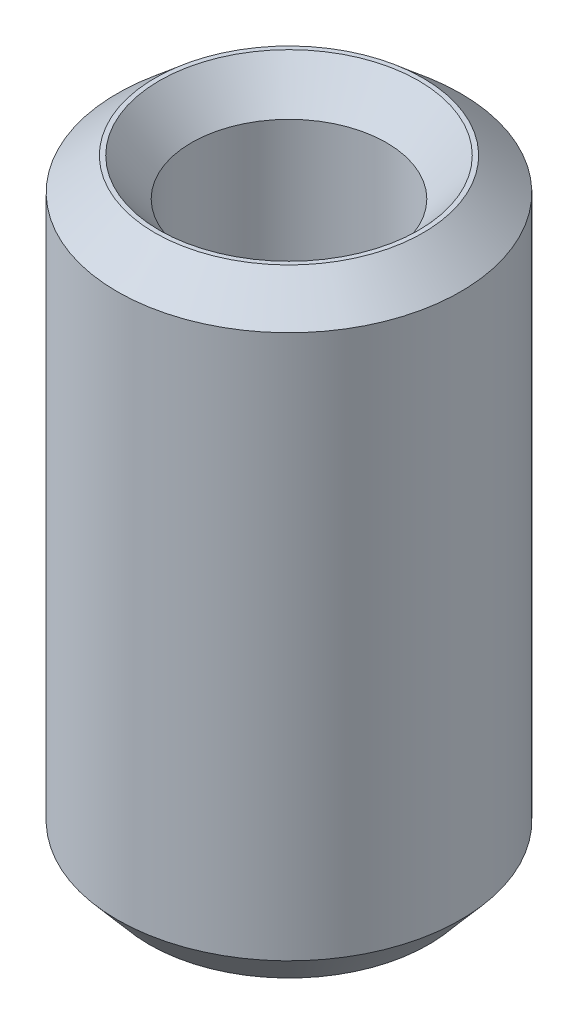
ISO-10303-21;
HEADER;
FILE_DESCRIPTION(('STEP AP214'),'2;1');
FILE_NAME('part.step','',(''),(''),'','','');
FILE_SCHEMA(('AUTOMOTIVE_DESIGN { 1 0 10303 214 1 1 1 1 }'));
ENDSEC;
DATA;
#1=APPLICATION_CONTEXT('core data for automotive mechanical design processes');
#2=APPLICATION_PROTOCOL_DEFINITION('international standard','automotive_design',2000,#1);
#3=PRODUCT_CONTEXT('',#1,'mechanical');
#4=PRODUCT('Part','Part','',(#3));
#5=PRODUCT_RELATED_PRODUCT_CATEGORY('part','',(#4));
#6=PRODUCT_DEFINITION_FORMATION('','',#4);
#7=PRODUCT_DEFINITION_CONTEXT('part definition',#1,'design');
#8=PRODUCT_DEFINITION('design','',#6,#7);
#9=PRODUCT_DEFINITION_SHAPE('','',#8);
#10=(LENGTH_UNIT() NAMED_UNIT(*) SI_UNIT(.MILLI.,.METRE.));
#11=(NAMED_UNIT(*) PLANE_ANGLE_UNIT() SI_UNIT($,.RADIAN.));
#12=(NAMED_UNIT(*) SI_UNIT($,.STERADIAN.) SOLID_ANGLE_UNIT());
#13=UNCERTAINTY_MEASURE_WITH_UNIT(LENGTH_MEASURE(1.E-05),#10,'distance_accuracy_value','');
#14=(GEOMETRIC_REPRESENTATION_CONTEXT(3) GLOBAL_UNCERTAINTY_ASSIGNED_CONTEXT((#13)) GLOBAL_UNIT_ASSIGNED_CONTEXT((#10,
#11,#12)) REPRESENTATION_CONTEXT('',''));
#15=CARTESIAN_POINT('',(0.,0.,0.));
#16=DIRECTION('',(0.,0.,1.));
#17=DIRECTION('',(1.,0.,0.));
#18=AXIS2_PLACEMENT_3D('',#15,#16,#17);
#19=CARTESIAN_POINT('',(0.,53.6103072465279,0.));
#20=DIRECTION('',(0.,-1.,0.));
#21=DIRECTION('',(0.,0.,-1.));
#22=AXIS2_PLACEMENT_3D('',#19,#20,#21);
#23=CYLINDRICAL_SURFACE('',#22,15.);
#24=CARTESIAN_POINT('',(0.,3.28486717726474,0.));
#25=DIRECTION('',(0.,1.,0.));
#26=DIRECTION('',(0.,0.,1.));
#27=AXIS2_PLACEMENT_3D('',#24,#25,#26);
#28=CIRCLE('',#27,15.);
#29=CARTESIAN_POINT('',(0.,3.28486717726473,-15.));
#30=VERTEX_POINT('',#29);
#31=EDGE_CURVE('E10',#30,#30,#28,.T.);
#32=CARTESIAN_POINT('',(0.,50.8042063282437,0.));
#33=DIRECTION('',(0.,1.,0.));
#34=DIRECTION('',(0.,0.,1.));
#35=AXIS2_PLACEMENT_3D('',#32,#33,#34);
#36=CIRCLE('',#35,15.);
#37=CARTESIAN_POINT('',(0.,50.8042063282437,-15.));
#38=VERTEX_POINT('',#37);
#39=EDGE_CURVE('E50',#38,#38,#36,.F.);
#40=CARTESIAN_POINT('',(0.,3.28486717726473,-15.));
#41=CARTESIAN_POINT('',(0.,3.77986029342077,-15.));
#42=CARTESIAN_POINT('',(0.,4.2748534095768,-15.));
#43=CARTESIAN_POINT('',(0.,5.26483964188886,-15.));
#44=CARTESIAN_POINT('',(0.,5.75983275804489,-15.));
#45=CARTESIAN_POINT('',(0.,6.74981899035695,-15.));
#46=CARTESIAN_POINT('',(0.,7.24481210651298,-15.));
#47=CARTESIAN_POINT('',(0.,8.23479833882505,-15.));
#48=CARTESIAN_POINT('',(0.,8.72979145498108,-15.));
#49=CARTESIAN_POINT('',(0.,9.71977768729314,-15.));
#50=CARTESIAN_POINT('',(0.,10.2147708034492,-15.));
#51=CARTESIAN_POINT('',(0.,11.2047570357612,-15.));
#52=CARTESIAN_POINT('',(0.,11.6997501519173,-15.));
#53=CARTESIAN_POINT('',(0.,12.6897363842293,-15.));
#54=CARTESIAN_POINT('',(0.,13.1847295003854,-15.));
#55=CARTESIAN_POINT('',(0.,14.1747157326974,-15.));
#56=CARTESIAN_POINT('',(0.,14.6697088488534,-15.));
#57=CARTESIAN_POINT('',(0.,15.6596950811655,-15.));
#58=CARTESIAN_POINT('',(0.,16.1546881973215,-15.));
#59=CARTESIAN_POINT('',(0.,17.1446744296336,-15.));
#60=CARTESIAN_POINT('',(0.,17.6396675457896,-15.));
#61=CARTESIAN_POINT('',(0.,18.6296537781017,-15.));
#62=CARTESIAN_POINT('',(0.,19.1246468942577,-15.));
#63=CARTESIAN_POINT('',(0.,20.1146331265698,-15.));
#64=CARTESIAN_POINT('',(0.,20.6096262427258,-15.));
#65=CARTESIAN_POINT('',(0.,21.5996124750379,-15.));
#66=CARTESIAN_POINT('',(0.,22.0946055911939,-15.));
#67=CARTESIAN_POINT('',(0.,23.084591823506,-15.));
#68=CARTESIAN_POINT('',(0.,23.579584939662,-15.));
#69=CARTESIAN_POINT('',(0.,24.5695711719741,-15.));
#70=CARTESIAN_POINT('',(0.,25.0645642881301,-15.));
#71=CARTESIAN_POINT('',(0.,26.0545505204422,-15.));
#72=CARTESIAN_POINT('',(0.,26.5495436365982,-15.));
#73=CARTESIAN_POINT('',(0.,27.5395298689103,-15.));
#74=CARTESIAN_POINT('',(0.,28.0345229850663,-15.));
#75=CARTESIAN_POINT('',(0.,29.0245092173783,-15.));
#76=CARTESIAN_POINT('',(0.,29.5195023335344,-15.));
#77=CARTESIAN_POINT('',(0.,30.5094885658464,-15.));
#78=CARTESIAN_POINT('',(0.,31.0044816820025,-15.));
#79=CARTESIAN_POINT('',(0.,31.9944679143145,-15.));
#80=CARTESIAN_POINT('',(0.,32.4894610304706,-15.));
#81=CARTESIAN_POINT('',(0.,33.4794472627826,-15.));
#82=CARTESIAN_POINT('',(0.,33.9744403789387,-15.));
#83=CARTESIAN_POINT('',(0.,34.9644266112507,-15.));
#84=CARTESIAN_POINT('',(0.,35.4594197274068,-15.));
#85=CARTESIAN_POINT('',(0.,36.4494059597188,-15.));
#86=CARTESIAN_POINT('',(0.,36.9443990758748,-15.));
#87=CARTESIAN_POINT('',(0.,37.9343853081869,-15.));
#88=CARTESIAN_POINT('',(0.,38.4293784243429,-15.));
#89=CARTESIAN_POINT('',(0.,39.419364656655,-15.));
#90=CARTESIAN_POINT('',(0.,39.914357772811,-15.));
#91=CARTESIAN_POINT('',(0.,40.9043440051231,-15.));
#92=CARTESIAN_POINT('',(0.,41.3993371212791,-15.));
#93=CARTESIAN_POINT('',(0.,42.3893233535912,-15.));
#94=CARTESIAN_POINT('',(0.,42.8843164697472,-15.));
#95=CARTESIAN_POINT('',(0.,43.8743027020593,-15.));
#96=CARTESIAN_POINT('',(0.,44.3692958182153,-15.));
#97=CARTESIAN_POINT('',(0.,45.3592820505274,-15.));
#98=CARTESIAN_POINT('',(0.,45.8542751666834,-15.));
#99=CARTESIAN_POINT('',(0.,46.8442613989955,-15.));
#100=CARTESIAN_POINT('',(0.,47.3392545151515,-15.));
#101=CARTESIAN_POINT('',(0.,48.3292407474636,-15.));
#102=CARTESIAN_POINT('',(0.,48.8242338636196,-15.));
#103=CARTESIAN_POINT('',(0.,49.8142200959316,-15.));
#104=CARTESIAN_POINT('',(0.,50.3092132120877,-15.));
#105=CARTESIAN_POINT('',(0.,50.8042063282437,-15.));
#106=B_SPLINE_CURVE_WITH_KNOTS('',3,(#40,#41,#42,#43,#44,#45,#46,#47,#48,#49,#50,#51,#52,#53,
#54,#55,#56,#57,#58,#59,#60,#61,#62,#63,#64,#65,#66,#67,#68,#69,#70,#71,#72,#73,#74,#75,#76,#77,
#78,#79,#80,#81,#82,#83,#84,#85,#86,#87,#88,#89,#90,#91,#92,#93,#94,#95,#96,#97,#98,#99,#100,
#101,#102,#103,#104,#105),.UNSPECIFIED.,.F.,.F.,(4,2,2,2,2,2,2,2,2,2,2,2,2,2,2,2,2,2,2,2,2,2,2,
2,2,2,2,2,2,2,2,2,4),(0.,1.48497934846809,2.96995869693618,4.45493804540428,5.93991739387238,
7.42489674234047,8.90987609080856,10.3948554392767,11.8798347877447,13.3648141362128,
14.8497934846809,16.334772833149,17.8197521816171,19.3047315300852,20.7897108785533,
22.2746902270214,23.7596695754895,25.2446489239576,26.7296282724257,28.2146076208938,
29.6995869693619,31.18456631783,32.669545666298,34.1545250147661,35.6395043632342,
37.1244837117023,38.6094630601704,40.0944424086385,41.5794217571066,43.0644011055747,
44.5493804540428,46.0343598025109,47.519339150979),.UNSPECIFIED.);
#107=EDGE_CURVE('BSEAM39',#30,#38,#106,.T.);
#108=ORIENTED_EDGE('',*,*,#31,.T.);
#109=ORIENTED_EDGE('',*,*,#39,.T.);
#110=ORIENTED_EDGE('',*,*,#107,.T.);
#111=ORIENTED_EDGE('',*,*,#107,.F.);
#112=EDGE_LOOP('',(#108,#110,#109,#111));
#113=FACE_BOUND('',#112,.T.);
#114=ADVANCED_FACE('F39',(#113),#23,.T.);
#115=CARTESIAN_POINT('',(0.,53.6103072465279,0.));
#116=DIRECTION('',(0.,1.,0.));
#117=DIRECTION('',(0.,0.,1.));
#118=AXIS2_PLACEMENT_3D('',#115,#116,#117);
#119=PLANE('',#118);
#120=CARTESIAN_POINT('',(0.,53.6103072465279,0.));
#121=DIRECTION('',(0.,1.,0.));
#122=DIRECTION('',(0.,0.,1.));
#123=AXIS2_PLACEMENT_3D('',#120,#121,#122);
#124=CIRCLE('',#123,11.3215243879318);
#125=CARTESIAN_POINT('',(0.,53.6103072465279,11.3215243879318));
#126=VERTEX_POINT('',#125);
#127=EDGE_CURVE('E58',#126,#126,#124,.F.);
#128=ORIENTED_EDGE('',*,*,#127,.T.);
#129=EDGE_LOOP('',(#128));
#130=FACE_BOUND('',#129,.T.);
#131=CARTESIAN_POINT('',(0.,53.6103072465279,0.));
#132=DIRECTION('',(0.,1.,0.));
#133=DIRECTION('',(0.,0.,1.));
#134=AXIS2_PLACEMENT_3D('',#131,#132,#133);
#135=CIRCLE('',#134,11.7151328227354);
#136=CARTESIAN_POINT('',(0.,53.6103072465279,-11.7151328227354));
#137=VERTEX_POINT('',#136);
#138=EDGE_CURVE('E61',#137,#137,#135,.T.);
#139=ORIENTED_EDGE('',*,*,#138,.T.);
#140=EDGE_LOOP('',(#139));
#141=FACE_BOUND('',#140,.T.);
#142=ADVANCED_FACE('F88',(#130,#141),#119,.T.);
#143=CARTESIAN_POINT('',(0.,0.,0.));
#144=DIRECTION('',(0.,1.,0.));
#145=DIRECTION('',(0.,0.,1.));
#146=AXIS2_PLACEMENT_3D('',#143,#144,#145);
#147=PLANE('',#146);
#148=CARTESIAN_POINT('',(0.,0.,0.));
#149=DIRECTION('',(0.,1.,0.));
#150=DIRECTION('',(0.,0.,1.));
#151=AXIS2_PLACEMENT_3D('',#148,#149,#150);
#152=CIRCLE('',#151,11.8002906469122);
#153=CARTESIAN_POINT('',(0.,0.,11.8002906469122));
#154=VERTEX_POINT('',#153);
#155=EDGE_CURVE('E51',#154,#154,#152,.T.);
#156=ORIENTED_EDGE('',*,*,#155,.T.);
#157=EDGE_LOOP('',(#156));
#158=FACE_BOUND('',#157,.T.);
#159=CARTESIAN_POINT('',(0.,0.,0.));
#160=DIRECTION('',(0.,1.,0.));
#161=DIRECTION('',(0.,0.,1.));
#162=AXIS2_PLACEMENT_3D('',#159,#160,#161);
#163=CIRCLE('',#162,12.1938990817157);
#164=CARTESIAN_POINT('',(0.,0.,12.1938990817157));
#165=VERTEX_POINT('',#164);
#166=EDGE_CURVE('E54',#165,#165,#163,.F.);
#167=ORIENTED_EDGE('',*,*,#166,.T.);
#168=EDGE_LOOP('',(#167));
#169=FACE_BOUND('',#168,.T.);
#170=ADVANCED_FACE('F83',(#158,#169),#147,.F.);
#171=CARTESIAN_POINT('',(0.,53.6103072465279,0.));
#172=DIRECTION('',(0.,-1.,0.));
#173=DIRECTION('',(0.,0.,-1.));
#174=AXIS2_PLACEMENT_3D('',#171,#172,#173);
#175=CYLINDRICAL_SURFACE('',#174,8.51542346964752);
#176=CARTESIAN_POINT('',(0.,50.3254400692632,0.));
#177=DIRECTION('',(0.,1.,0.));
#178=DIRECTION('',(0.,0.,1.));
#179=AXIS2_PLACEMENT_3D('',#176,#177,#178);
#180=CIRCLE('',#179,8.51542346964752);
#181=CARTESIAN_POINT('',(0.,50.3254400692632,-8.51542346964752));
#182=VERTEX_POINT('',#181);
#183=EDGE_CURVE('E67',#182,#182,#180,.T.);
#184=CARTESIAN_POINT('',(0.,2.80610091828423,0.));
#185=DIRECTION('',(0.,1.,0.));
#186=DIRECTION('',(0.,0.,1.));
#187=AXIS2_PLACEMENT_3D('',#184,#185,#186);
#188=CIRCLE('',#187,8.51542346964752);
#189=CARTESIAN_POINT('',(0.,2.80610091828423,-8.51542346964752));
#190=VERTEX_POINT('',#189);
#191=EDGE_CURVE('E69',#190,#190,#188,.F.);
#192=CARTESIAN_POINT('',(0.,50.3254400692632,-8.51542346964752));
#193=CARTESIAN_POINT('',(0.,49.8304469531072,-8.51542346964752));
#194=CARTESIAN_POINT('',(0.,49.3354538369511,-8.51542346964752));
#195=CARTESIAN_POINT('',(0.,48.3454676046391,-8.51542346964752));
#196=CARTESIAN_POINT('',(0.,47.850474488483,-8.51542346964752));
#197=CARTESIAN_POINT('',(0.,46.860488256171,-8.51542346964752));
#198=CARTESIAN_POINT('',(0.,46.3654951400149,-8.51542346964752));
#199=CARTESIAN_POINT('',(0.,45.3755089077029,-8.51542346964752));
#200=CARTESIAN_POINT('',(0.,44.8805157915468,-8.51542346964752));
#201=CARTESIAN_POINT('',(0.,43.8905295592348,-8.51542346964752));
#202=CARTESIAN_POINT('',(0.,43.3955364430788,-8.51542346964752));
#203=CARTESIAN_POINT('',(0.,42.4055502107667,-8.51542346964752));
#204=CARTESIAN_POINT('',(0.,41.9105570946107,-8.51542346964752));
#205=CARTESIAN_POINT('',(0.,40.9205708622986,-8.51542346964752));
#206=CARTESIAN_POINT('',(0.,40.4255777461426,-8.51542346964752));
#207=CARTESIAN_POINT('',(0.,39.4355915138305,-8.51542346964752));
#208=CARTESIAN_POINT('',(0.,38.9405983976745,-8.51542346964752));
#209=CARTESIAN_POINT('',(0.,37.9506121653624,-8.51542346964752));
#210=CARTESIAN_POINT('',(0.,37.4556190492064,-8.51542346964752));
#211=CARTESIAN_POINT('',(0.,36.4656328168943,-8.51542346964752));
#212=CARTESIAN_POINT('',(0.,35.9706397007383,-8.51542346964752));
#213=CARTESIAN_POINT('',(0.,34.9806534684262,-8.51542346964752));
#214=CARTESIAN_POINT('',(0.,34.4856603522702,-8.51542346964752));
#215=CARTESIAN_POINT('',(0.,33.4956741199581,-8.51542346964752));
#216=CARTESIAN_POINT('',(0.,33.0006810038021,-8.51542346964752));
#217=CARTESIAN_POINT('',(0.,32.0106947714901,-8.51542346964752));
#218=CARTESIAN_POINT('',(0.,31.515701655334,-8.51542346964752));
#219=CARTESIAN_POINT('',(0.,30.525715423022,-8.51542346964752));
#220=CARTESIAN_POINT('',(0.,30.0307223068659,-8.51542346964752));
#221=CARTESIAN_POINT('',(0.,29.0407360745539,-8.51542346964752));
#222=CARTESIAN_POINT('',(0.,28.5457429583978,-8.51542346964752));
#223=CARTESIAN_POINT('',(0.,27.5557567260858,-8.51542346964752));
#224=CARTESIAN_POINT('',(0.,27.0607636099297,-8.51542346964752));
#225=CARTESIAN_POINT('',(0.,26.0707773776177,-8.51542346964752));
#226=CARTESIAN_POINT('',(0.,25.5757842614617,-8.51542346964752));
#227=CARTESIAN_POINT('',(0.,24.5857980291496,-8.51542346964752));
#228=CARTESIAN_POINT('',(0.,24.0908049129936,-8.51542346964752));
#229=CARTESIAN_POINT('',(0.,23.1008186806815,-8.51542346964752));
#230=CARTESIAN_POINT('',(0.,22.6058255645255,-8.51542346964752));
#231=CARTESIAN_POINT('',(0.,21.6158393322134,-8.51542346964752));
#232=CARTESIAN_POINT('',(0.,21.1208462160574,-8.51542346964752));
#233=CARTESIAN_POINT('',(0.,20.1308599837453,-8.51542346964752));
#234=CARTESIAN_POINT('',(0.,19.6358668675893,-8.51542346964752));
#235=CARTESIAN_POINT('',(0.,18.6458806352772,-8.51542346964752));
#236=CARTESIAN_POINT('',(0.,18.1508875191212,-8.51542346964752));
#237=CARTESIAN_POINT('',(0.,17.1609012868091,-8.51542346964752));
#238=CARTESIAN_POINT('',(0.,16.6659081706531,-8.51542346964752));
#239=CARTESIAN_POINT('',(0.,15.675921938341,-8.51542346964752));
#240=CARTESIAN_POINT('',(0.,15.180928822185,-8.51542346964752));
#241=CARTESIAN_POINT('',(0.,14.1909425898729,-8.51542346964752));
#242=CARTESIAN_POINT('',(0.,13.6959494737169,-8.51542346964752));
#243=CARTESIAN_POINT('',(0.,12.7059632414048,-8.51542346964752));
#244=CARTESIAN_POINT('',(0.,12.2109701252488,-8.51542346964752));
#245=CARTESIAN_POINT('',(0.,11.2209838929368,-8.51542346964752));
#246=CARTESIAN_POINT('',(0.,10.7259907767807,-8.51542346964752));
#247=CARTESIAN_POINT('',(0.,9.73600454446866,-8.51542346964752));
#248=CARTESIAN_POINT('',(0.,9.24101142831263,-8.51542346964752));
#249=CARTESIAN_POINT('',(0.,8.25102519600057,-8.51542346964752));
#250=CARTESIAN_POINT('',(0.,7.75603207984454,-8.51542346964752));
#251=CARTESIAN_POINT('',(0.,6.76604584753248,-8.51542346964752));
#252=CARTESIAN_POINT('',(0.,6.27105273137644,-8.51542346964752));
#253=CARTESIAN_POINT('',(0.,5.28106649906438,-8.51542346964752));
#254=CARTESIAN_POINT('',(0.,4.78607338290835,-8.51542346964752));
#255=CARTESIAN_POINT('',(0.,3.79608715059629,-8.51542346964752));
#256=CARTESIAN_POINT('',(0.,3.30109403444026,-8.51542346964752));
#257=CARTESIAN_POINT('',(0.,2.80610091828423,-8.51542346964752));
#258=B_SPLINE_CURVE_WITH_KNOTS('',3,(#192,#193,#194,#195,#196,#197,#198,#199,#200,#201,#202,
#203,#204,#205,#206,#207,#208,#209,#210,#211,#212,#213,#214,#215,#216,#217,#218,#219,#220,#221,
#222,#223,#224,#225,#226,#227,#228,#229,#230,#231,#232,#233,#234,#235,#236,#237,#238,#239,#240,
#241,#242,#243,#244,#245,#246,#247,#248,#249,#250,#251,#252,#253,#254,#255,#256,#257),
.UNSPECIFIED.,.F.,.F.,(4,2,2,2,2,2,2,2,2,2,2,2,2,2,2,2,2,2,2,2,2,2,2,2,2,2,2,2,2,2,2,2,4),(0.,
1.48497934846809,2.96995869693619,4.45493804540428,5.93991739387238,7.42489674234047,
8.90987609080856,10.3948554392767,11.8798347877447,13.3648141362128,14.8497934846809,
16.334772833149,17.8197521816171,19.3047315300852,20.7897108785533,22.2746902270214,
23.7596695754895,25.2446489239576,26.7296282724257,28.2146076208938,29.6995869693619,
31.1845663178299,32.669545666298,34.1545250147661,35.6395043632342,37.1244837117023,
38.6094630601704,40.0944424086385,41.5794217571066,43.0644011055747,44.5493804540428,
46.0343598025109,47.519339150979),.UNSPECIFIED.);
#259=EDGE_CURVE('BSEAM71',#182,#190,#258,.T.);
#260=ORIENTED_EDGE('',*,*,#183,.T.);
#261=ORIENTED_EDGE('',*,*,#191,.T.);
#262=ORIENTED_EDGE('',*,*,#259,.T.);
#263=ORIENTED_EDGE('',*,*,#259,.F.);
#264=EDGE_LOOP('',(#260,#262,#261,#263));
#265=FACE_BOUND('',#264,.T.);
#266=ADVANCED_FACE('F71',(#265),#175,.F.);
#267=CARTESIAN_POINT('',(0.,50.3254400692632,0.));
#268=DIRECTION('',(0.,1.,0.));
#269=DIRECTION('',(0.,0.,1.));
#270=AXIS2_PLACEMENT_3D('',#267,#268,#269);
#271=CONICAL_SURFACE('',#270,8.51542346964752,0.706956790689903);
#272=ORIENTED_EDGE('',*,*,#127,.F.);
#273=EDGE_LOOP('',(#272));
#274=FACE_BOUND('',#273,.T.);
#275=ORIENTED_EDGE('',*,*,#183,.F.);
#276=EDGE_LOOP('',(#275));
#277=FACE_BOUND('',#276,.T.);
#278=ADVANCED_FACE('F77',(#274,#277),#271,.F.);
#279=CARTESIAN_POINT('',(0.,0.,0.));
#280=DIRECTION('',(0.,-1.,0.));
#281=DIRECTION('',(0.,0.,-1.));
#282=AXIS2_PLACEMENT_3D('',#279,#280,#281);
#283=CONICAL_SURFACE('',#282,11.8002906469122,0.863839536104992);
#284=ORIENTED_EDGE('',*,*,#191,.F.);
#285=EDGE_LOOP('',(#284));
#286=FACE_BOUND('',#285,.T.);
#287=ORIENTED_EDGE('',*,*,#155,.F.);
#288=EDGE_LOOP('',(#287));
#289=FACE_BOUND('',#288,.T.);
#290=ADVANCED_FACE('F73',(#286,#289),#283,.F.);
#291=CARTESIAN_POINT('',(0.,3.28486717726474,0.));
#292=DIRECTION('',(0.,1.,0.));
#293=DIRECTION('',(0.,0.,1.));
#294=AXIS2_PLACEMENT_3D('',#291,#292,#293);
#295=CONICAL_SURFACE('',#294,15.,0.706956790689904);
#296=ORIENTED_EDGE('',*,*,#166,.F.);
#297=EDGE_LOOP('',(#296));
#298=FACE_BOUND('',#297,.T.);
#299=ORIENTED_EDGE('',*,*,#31,.F.);
#300=EDGE_LOOP('',(#299));
#301=FACE_BOUND('',#300,.T.);
#302=ADVANCED_FACE('F76',(#298,#301),#295,.T.);
#303=CARTESIAN_POINT('',(0.,53.6103072465279,0.));
#304=DIRECTION('',(0.,-1.,0.));
#305=DIRECTION('',(0.,0.,-1.));
#306=AXIS2_PLACEMENT_3D('',#303,#304,#305);
#307=CONICAL_SURFACE('',#306,11.7151328227354,0.863839536104992);
#308=CARTESIAN_POINT('',(0.,50.8042063282437,-15.));
#309=CARTESIAN_POINT('',(0.,50.8334365461425,-14.9657826335702));
#310=CARTESIAN_POINT('',(0.,50.8626667640413,-14.9315652671403));
#311=CARTESIAN_POINT('',(0.,50.9211271998389,-14.8631305342806));
#312=CARTESIAN_POINT('',(0.,50.9503574177377,-14.8289131678508));
#313=CARTESIAN_POINT('',(0.,51.0088178535353,-14.7604784349911));
#314=CARTESIAN_POINT('',(0.,51.0380480714341,-14.7262610685613));
#315=CARTESIAN_POINT('',(0.,51.0965085072317,-14.6578263357016));
#316=CARTESIAN_POINT('',(0.,51.1257387251304,-14.6236089692718));
#317=CARTESIAN_POINT('',(0.,51.184199160928,-14.5551742364121));
#318=CARTESIAN_POINT('',(0.,51.2134293788268,-14.5209568699822));
#319=CARTESIAN_POINT('',(0.,51.2718898146244,-14.4525221371226));
#320=CARTESIAN_POINT('',(0.,51.3011200325232,-14.4183047706927));
#321=CARTESIAN_POINT('',(0.,51.3595804683208,-14.349870037833));
#322=CARTESIAN_POINT('',(0.,51.3888106862196,-14.3156526714032));
#323=CARTESIAN_POINT('',(0.,51.4472711220172,-14.2472179385435));
#324=CARTESIAN_POINT('',(0.,51.476501339916,-14.2130005721137));
#325=CARTESIAN_POINT('',(0.,51.5349617757136,-14.144565839254));
#326=CARTESIAN_POINT('',(0.,51.5641919936124,-14.1103484728242));
#327=CARTESIAN_POINT('',(0.,51.6226524294099,-14.0419137399645));
#328=CARTESIAN_POINT('',(0.,51.6518826473087,-14.0076963735346));
#329=CARTESIAN_POINT('',(0.,51.7103430831063,-13.939261640675));
#330=CARTESIAN_POINT('',(0.,51.7395733010051,-13.9050442742451));
#331=CARTESIAN_POINT('',(0.,51.7980337368027,-13.8366095413854));
#332=CARTESIAN_POINT('',(0.,51.8272639547015,-13.8023921749556));
#333=CARTESIAN_POINT('',(0.,51.8857243904991,-13.7339574420959));
#334=CARTESIAN_POINT('',(0.,51.9149546083979,-13.6997400756661));
#335=CARTESIAN_POINT('',(0.,51.9734150441955,-13.6313053428064));
#336=CARTESIAN_POINT('',(0.,52.0026452620943,-13.5970879763766));
#337=CARTESIAN_POINT('',(0.,52.0611056978919,-13.5286532435169));
#338=CARTESIAN_POINT('',(0.,52.0903359157906,-13.494435877087));
#339=CARTESIAN_POINT('',(0.,52.1487963515882,-13.4260011442274));
#340=CARTESIAN_POINT('',(0.,52.178026569487,-13.3917837777975));
#341=CARTESIAN_POINT('',(0.,52.2364870052846,-13.3233490449378));
#342=CARTESIAN_POINT('',(0.,52.2657172231834,-13.289131678508));
#343=CARTESIAN_POINT('',(0.,52.324177658981,-13.2206969456483));
#344=CARTESIAN_POINT('',(0.,52.3534078768798,-13.1864795792185));
#345=CARTESIAN_POINT('',(0.,52.4118683126774,-13.1180448463588));
#346=CARTESIAN_POINT('',(0.,52.4410985305762,-13.083827479929));
#347=CARTESIAN_POINT('',(0.,52.4995589663738,-13.0153927470693));
#348=CARTESIAN_POINT('',(0.,52.5287891842726,-12.9811753806394));
#349=CARTESIAN_POINT('',(0.,52.5872496200701,-12.9127406477798));
#350=CARTESIAN_POINT('',(0.,52.6164798379689,-12.8785232813499));
#351=CARTESIAN_POINT('',(0.,52.6749402737665,-12.8100885484902));
#352=CARTESIAN_POINT('',(0.,52.7041704916653,-12.7758711820604));
#353=CARTESIAN_POINT('',(0.,52.7626309274629,-12.7074364492007));
#354=CARTESIAN_POINT('',(0.,52.7918611453617,-12.6732190827709));
#355=CARTESIAN_POINT('',(0.,52.8503215811593,-12.6047843499112));
#356=CARTESIAN_POINT('',(0.,52.8795517990581,-12.5705669834814));
#357=CARTESIAN_POINT('',(0.,52.9380122348557,-12.5021322506217));
#358=CARTESIAN_POINT('',(0.,52.9672424527545,-12.4679148841918));
#359=CARTESIAN_POINT('',(0.,53.0257028885521,-12.3994801513322));
#360=CARTESIAN_POINT('',(0.,53.0549331064508,-12.3652627849023));
#361=CARTESIAN_POINT('',(0.,53.1133935422484,-12.2968280520426));
#362=CARTESIAN_POINT('',(0.,53.1426237601472,-12.2626106856128));
#363=CARTESIAN_POINT('',(0.,53.2010841959448,-12.1941759527531));
#364=CARTESIAN_POINT('',(0.,53.2303144138436,-12.1599585863233));
#365=CARTESIAN_POINT('',(0.,53.2887748496412,-12.0915238534636));
#366=CARTESIAN_POINT('',(0.,53.31800506754,-12.0573064870338));
#367=CARTESIAN_POINT('',(0.,53.3764655033376,-11.9888717541741));
#368=CARTESIAN_POINT('',(0.,53.4056957212364,-11.9546543877442));
#369=CARTESIAN_POINT('',(0.,53.464156157034,-11.8862196548846));
#370=CARTESIAN_POINT('',(0.,53.4933863749328,-11.8520022884547));
#371=CARTESIAN_POINT('',(0.,53.5518468107303,-11.783567555595));
#372=CARTESIAN_POINT('',(0.,53.5810770286291,-11.7493501891652));
#373=CARTESIAN_POINT('',(0.,53.6103072465279,-11.7151328227354));
#374=B_SPLINE_CURVE_WITH_KNOTS('',3,(#308,#309,#310,#311,#312,#313,#314,#315,#316,#317,#318,
#319,#320,#321,#322,#323,#324,#325,#326,#327,#328,#329,#330,#331,#332,#333,#334,#335,#336,#337,
#338,#339,#340,#341,#342,#343,#344,#345,#346,#347,#348,#349,#350,#351,#352,#353,#354,#355,#356,
#357,#358,#359,#360,#361,#362,#363,#364,#365,#366,#367,#368,#369,#370,#371,#372,#373),
.UNSPECIFIED.,.F.,.F.,(4,2,2,2,2,2,2,2,2,2,2,2,2,2,2,2,2,2,2,2,2,2,2,2,2,2,2,2,2,2,2,2,4),(0.,
0.135007793235221,0.270015586470443,0.405023379705666,0.540031172940887,0.67503896617611,
0.810046759411327,0.94505455264655,1.08006234588177,1.21507013911699,1.35007793235222,
1.48508572558743,1.62009351882266,1.75510131205788,1.8901091052931,2.02511689852832,
2.16012469176354,2.29513248499876,2.43014027823398,2.5651480714692,2.70015586470443,
2.83516365793965,2.97017145117487,3.10517924441009,3.24018703764531,3.37519483088053,
3.51020262411575,3.64521041735097,3.78021821058619,3.91522600382142,4.05023379705664,
4.18524159029186,4.32024938352708),.UNSPECIFIED.);
#375=EDGE_CURVE('BSEAM45',#38,#137,#374,.T.);
#376=ORIENTED_EDGE('',*,*,#39,.F.);
#377=ORIENTED_EDGE('',*,*,#138,.F.);
#378=ORIENTED_EDGE('',*,*,#375,.T.);
#379=ORIENTED_EDGE('',*,*,#375,.F.);
#380=EDGE_LOOP('',(#376,#378,#377,#379));
#381=FACE_BOUND('',#380,.T.);
#382=ADVANCED_FACE('F45',(#381),#307,.T.);
#383=CLOSED_SHELL('',(#114,#142,#170,#266,#278,#290,#302,#382));
#384=MANIFOLD_SOLID_BREP('B2',#383);
#385=ADVANCED_BREP_SHAPE_REPRESENTATION('',(#18,#384),#14);
#386=SHAPE_DEFINITION_REPRESENTATION(#9,#385);
ENDSEC;
END-ISO-10303-21;
